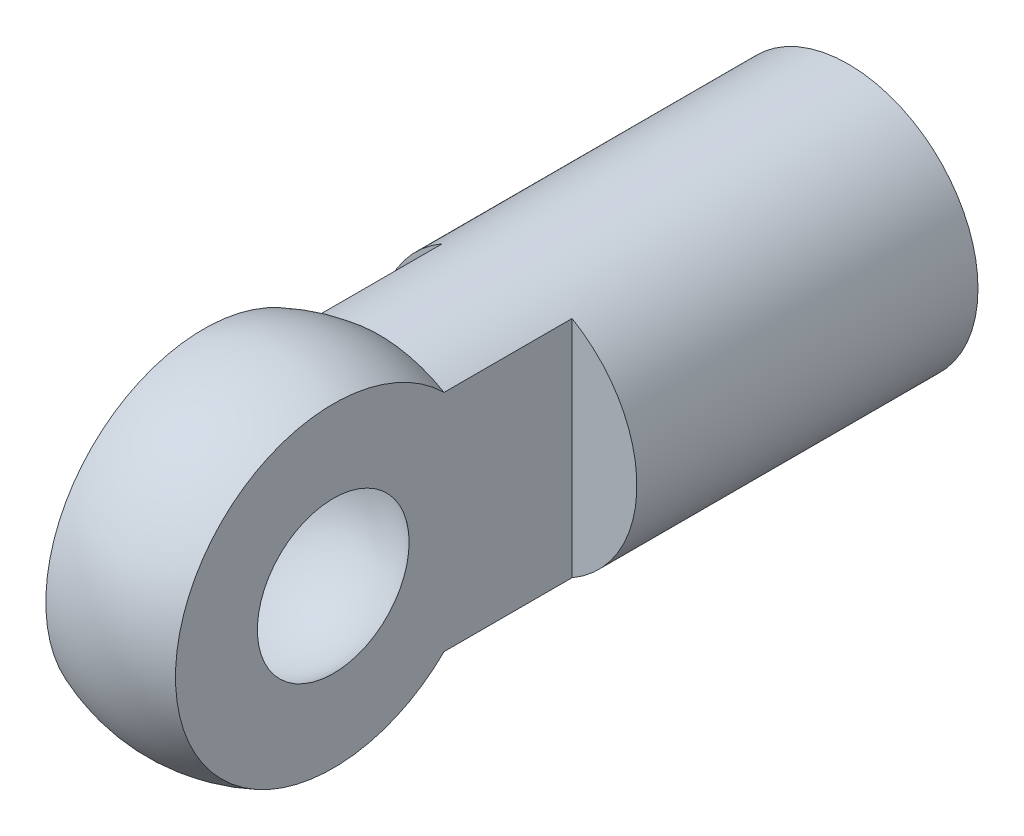
ISO-10303-21;
HEADER;
FILE_DESCRIPTION(('STEP AP214'),'2;1');
FILE_NAME('part.step','',(''),(''),'','','');
FILE_SCHEMA(('AUTOMOTIVE_DESIGN { 1 0 10303 214 1 1 1 1 }'));
ENDSEC;
DATA;
#1=APPLICATION_CONTEXT('core data for automotive mechanical design processes');
#2=APPLICATION_PROTOCOL_DEFINITION('international standard','automotive_design',2000,#1);
#3=PRODUCT_CONTEXT('',#1,'mechanical');
#4=PRODUCT('Part','Part','',(#3));
#5=PRODUCT_RELATED_PRODUCT_CATEGORY('part','',(#4));
#6=PRODUCT_DEFINITION_FORMATION('','',#4);
#7=PRODUCT_DEFINITION_CONTEXT('part definition',#1,'design');
#8=PRODUCT_DEFINITION('design','',#6,#7);
#9=PRODUCT_DEFINITION_SHAPE('','',#8);
#10=(LENGTH_UNIT() NAMED_UNIT(*) SI_UNIT(.MILLI.,.METRE.));
#11=(NAMED_UNIT(*) PLANE_ANGLE_UNIT() SI_UNIT($,.RADIAN.));
#12=(NAMED_UNIT(*) SI_UNIT($,.STERADIAN.) SOLID_ANGLE_UNIT());
#13=UNCERTAINTY_MEASURE_WITH_UNIT(LENGTH_MEASURE(1.E-05),#10,'distance_accuracy_value','');
#14=(GEOMETRIC_REPRESENTATION_CONTEXT(3) GLOBAL_UNCERTAINTY_ASSIGNED_CONTEXT((#13)) GLOBAL_UNIT_ASSIGNED_CONTEXT((#10,
#11,#12)) REPRESENTATION_CONTEXT('',''));
#15=CARTESIAN_POINT('',(0.,0.,0.));
#16=DIRECTION('',(0.,0.,1.));
#17=DIRECTION('',(1.,0.,0.));
#18=AXIS2_PLACEMENT_3D('',#15,#16,#17);
#19=CARTESIAN_POINT('',(-1.9,0.,-1.));
#20=DIRECTION('',(-1.,0.,0.));
#21=DIRECTION('',(0.,1.,0.));
#22=AXIS2_PLACEMENT_3D('',#19,#20,#21);
#23=PLANE('',#22);
#24=DIRECTION('',(0.,0.,-1.));
#25=VECTOR('',#24,1.);
#26=CARTESIAN_POINT('',(-1.9,-3.29089653438087,-10.1248076809272));
#27=LINE('',#26,#25);
#28=CARTESIAN_POINT('',(-1.9,-3.29089653438087,-3.24961536185438));
#29=VERTEX_POINT('',#28);
#30=CARTESIAN_POINT('',(-1.9,-3.29089653438087,-7.));
#31=VERTEX_POINT('',#30);
#32=EDGE_CURVE('E10',#29,#31,#27,.T.);
#33=ORIENTED_EDGE('',*,*,#32,.F.);
#34=CARTESIAN_POINT('',(-1.9,0.,0.));
#35=DIRECTION('',(1.,0.,0.));
#36=DIRECTION('',(0.,-1.,0.));
#37=AXIS2_PLACEMENT_3D('',#34,#35,#36);
#38=CIRCLE('',#37,4.62493243193887);
#39=CARTESIAN_POINT('',(-1.9,3.29089653438087,-3.24961536185438));
#40=VERTEX_POINT('',#39);
#41=EDGE_CURVE('E24',#40,#29,#38,.T.);
#42=ORIENTED_EDGE('',*,*,#41,.F.);
#43=DIRECTION('',(0.,0.,1.));
#44=VECTOR('',#43,1.);
#45=CARTESIAN_POINT('',(-1.9,3.29089653438087,-10.1248076809272));
#46=LINE('',#45,#44);
#47=CARTESIAN_POINT('',(-1.9,3.29089653438087,-7.));
#48=VERTEX_POINT('',#47);
#49=EDGE_CURVE('E98',#48,#40,#46,.T.);
#50=ORIENTED_EDGE('',*,*,#49,.F.);
#51=DIRECTION('',(0.,1.,0.));
#52=VECTOR('',#51,1.);
#53=CARTESIAN_POINT('',(-1.9,-3.8,-7.));
#54=LINE('',#53,#52);
#55=EDGE_CURVE('E94',#31,#48,#54,.T.);
#56=ORIENTED_EDGE('',*,*,#55,.F.);
#57=EDGE_LOOP('',(#33,#42,#50,#56));
#58=FACE_BOUND('',#57,.T.);
#59=CARTESIAN_POINT('',(-1.9,0.,0.));
#60=DIRECTION('',(-1.,0.,0.));
#61=DIRECTION('',(0.,0.,-1.));
#62=AXIS2_PLACEMENT_3D('',#59,#60,#61);
#63=CIRCLE('',#62,2.22387612065061);
#64=CARTESIAN_POINT('',(-1.9,0.,-2.22387612065061));
#65=VERTEX_POINT('',#64);
#66=EDGE_CURVE('E83',#65,#65,#63,.T.);
#67=ORIENTED_EDGE('',*,*,#66,.F.);
#68=EDGE_LOOP('',(#67));
#69=FACE_BOUND('',#68,.T.);
#70=ADVANCED_FACE('F15',(#58,#69),#23,.T.);
#71=CARTESIAN_POINT('',(0.,0.,0.));
#72=DIRECTION('',(1.,0.,0.));
#73=DIRECTION('',(0.,0.,-1.));
#74=AXIS2_PLACEMENT_3D('',#71,#72,#73);
#75=SPHERICAL_SURFACE('',#74,2.925);
#76=CARTESIAN_POINT('',(1.9,0.,0.));
#77=DIRECTION('',(1.,0.,0.));
#78=DIRECTION('',(0.,0.,-1.));
#79=AXIS2_PLACEMENT_3D('',#76,#77,#78);
#80=CIRCLE('',#79,2.22387612065061);
#81=CARTESIAN_POINT('',(1.9,0.,-2.22387612065061));
#82=VERTEX_POINT('',#81);
#83=EDGE_CURVE('E76',#82,#82,#80,.T.);
#84=ORIENTED_EDGE('',*,*,#83,.T.);
#85=EDGE_LOOP('',(#84));
#86=FACE_BOUND('',#85,.T.);
#87=ORIENTED_EDGE('',*,*,#66,.T.);
#88=EDGE_LOOP('',(#87));
#89=FACE_BOUND('',#88,.T.);
#90=ADVANCED_FACE('F162',(#86,#89),#75,.F.);
#91=CARTESIAN_POINT('',(1.9,0.,-1.));
#92=DIRECTION('',(1.,0.,0.));
#93=DIRECTION('',(0.,1.,0.));
#94=AXIS2_PLACEMENT_3D('',#91,#92,#93);
#95=PLANE('',#94);
#96=DIRECTION('',(0.,0.,1.));
#97=VECTOR('',#96,1.);
#98=CARTESIAN_POINT('',(1.9,-3.29089653438087,-10.1248076809272));
#99=LINE('',#98,#97);
#100=CARTESIAN_POINT('',(1.9,-3.29089653438087,-7.));
#101=VERTEX_POINT('',#100);
#102=CARTESIAN_POINT('',(1.9,-3.29089653438087,-3.24961536185438));
#103=VERTEX_POINT('',#102);
#104=EDGE_CURVE('E56',#101,#103,#99,.T.);
#105=ORIENTED_EDGE('',*,*,#104,.F.);
#106=DIRECTION('',(0.,1.,0.));
#107=VECTOR('',#106,1.);
#108=CARTESIAN_POINT('',(1.9,-3.8,-7.));
#109=LINE('',#108,#107);
#110=CARTESIAN_POINT('',(1.9,3.29089653438087,-7.));
#111=VERTEX_POINT('',#110);
#112=EDGE_CURVE('E77',#101,#111,#109,.T.);
#113=ORIENTED_EDGE('',*,*,#112,.T.);
#114=DIRECTION('',(0.,0.,-1.));
#115=VECTOR('',#114,1.);
#116=CARTESIAN_POINT('',(1.9,3.29089653438087,-10.1248076809272));
#117=LINE('',#116,#115);
#118=CARTESIAN_POINT('',(1.9,3.29089653438087,-3.24961536185438));
#119=VERTEX_POINT('',#118);
#120=EDGE_CURVE('E59',#119,#111,#117,.T.);
#121=ORIENTED_EDGE('',*,*,#120,.F.);
#122=CARTESIAN_POINT('',(1.9,0.,0.));
#123=DIRECTION('',(-1.,0.,0.));
#124=DIRECTION('',(0.,1.,0.));
#125=AXIS2_PLACEMENT_3D('',#122,#123,#124);
#126=CIRCLE('',#125,4.62493243193887);
#127=EDGE_CURVE('E51',#103,#119,#126,.T.);
#128=ORIENTED_EDGE('',*,*,#127,.F.);
#129=EDGE_LOOP('',(#105,#113,#121,#128));
#130=FACE_BOUND('',#129,.T.);
#131=ORIENTED_EDGE('',*,*,#83,.F.);
#132=EDGE_LOOP('',(#131));
#133=FACE_BOUND('',#132,.T.);
#134=ADVANCED_FACE('F53',(#130,#133),#95,.T.);
#135=CARTESIAN_POINT('',(0.,0.,0.));
#136=DIRECTION('',(1.,0.,0.));
#137=DIRECTION('',(0.,0.,-1.));
#138=AXIS2_PLACEMENT_3D('',#135,#136,#137);
#139=SPHERICAL_SURFACE('',#138,5.);
#140=ORIENTED_EDGE('',*,*,#41,.T.);
#141=CARTESIAN_POINT('',(0.,0.,-3.24961536185438));
#142=DIRECTION('',(0.,0.,-1.));
#143=DIRECTION('',(1.,0.,0.));
#144=AXIS2_PLACEMENT_3D('',#141,#142,#143);
#145=CIRCLE('',#144,3.8);
#146=EDGE_CURVE('E63',#103,#29,#145,.T.);
#147=ORIENTED_EDGE('',*,*,#146,.F.);
#148=ORIENTED_EDGE('',*,*,#127,.T.);
#149=CARTESIAN_POINT('',(0.,0.,-3.24961536185438));
#150=DIRECTION('',(0.,0.,-1.));
#151=DIRECTION('',(1.,0.,0.));
#152=AXIS2_PLACEMENT_3D('',#149,#150,#151);
#153=CIRCLE('',#152,3.8);
#154=EDGE_CURVE('E69',#40,#119,#153,.T.);
#155=ORIENTED_EDGE('',*,*,#154,.F.);
#156=EDGE_LOOP('',(#140,#147,#148,#155));
#157=FACE_BOUND('',#156,.T.);
#158=ADVANCED_FACE('F66',(#157),#139,.T.);
#159=CARTESIAN_POINT('',(0.,0.,-10.1248076809272));
#160=DIRECTION('',(0.,0.,-1.));
#161=DIRECTION('',(0.,1.,0.));
#162=AXIS2_PLACEMENT_3D('',#159,#160,#161);
#163=CYLINDRICAL_SURFACE('',#162,3.8);
#164=CARTESIAN_POINT('',(0.,0.,-17.));
#165=DIRECTION('',(0.,0.,-1.));
#166=DIRECTION('',(1.,0.,0.));
#167=AXIS2_PLACEMENT_3D('',#164,#165,#166);
#168=CIRCLE('',#167,3.8);
#169=CARTESIAN_POINT('',(3.8,0.,-17.));
#170=VERTEX_POINT('',#169);
#171=EDGE_CURVE('E122',#170,#170,#168,.T.);
#172=ORIENTED_EDGE('',*,*,#171,.F.);
#173=EDGE_LOOP('',(#172));
#174=FACE_BOUND('',#173,.T.);
#175=ORIENTED_EDGE('',*,*,#154,.T.);
#176=ORIENTED_EDGE('',*,*,#120,.T.);
#177=CARTESIAN_POINT('',(0.,0.,-7.));
#178=DIRECTION('',(0.,0.,-1.));
#179=DIRECTION('',(0.,1.,0.));
#180=AXIS2_PLACEMENT_3D('',#177,#178,#179);
#181=CIRCLE('',#180,3.8);
#182=EDGE_CURVE('E73',#111,#101,#181,.T.);
#183=ORIENTED_EDGE('',*,*,#182,.T.);
#184=ORIENTED_EDGE('',*,*,#104,.T.);
#185=ORIENTED_EDGE('',*,*,#146,.T.);
#186=ORIENTED_EDGE('',*,*,#32,.T.);
#187=CARTESIAN_POINT('',(0.,0.,-7.));
#188=DIRECTION('',(0.,0.,-1.));
#189=DIRECTION('',(0.,1.,0.));
#190=AXIS2_PLACEMENT_3D('',#187,#188,#189);
#191=CIRCLE('',#190,3.8);
#192=EDGE_CURVE('E113',#31,#48,#191,.T.);
#193=ORIENTED_EDGE('',*,*,#192,.T.);
#194=ORIENTED_EDGE('',*,*,#49,.T.);
#195=EDGE_LOOP('',(#175,#176,#183,#184,#185,#186,#193,#194));
#196=FACE_BOUND('',#195,.T.);
#197=ADVANCED_FACE('F71',(#174,#196),#163,.T.);
#198=CARTESIAN_POINT('',(-1.9,-3.8,-7.));
#199=DIRECTION('',(0.,0.,-1.));
#200=DIRECTION('',(0.,1.,0.));
#201=AXIS2_PLACEMENT_3D('',#198,#199,#200);
#202=PLANE('',#201);
#203=ORIENTED_EDGE('',*,*,#192,.F.);
#204=ORIENTED_EDGE('',*,*,#55,.T.);
#205=EDGE_LOOP('',(#203,#204));
#206=FACE_BOUND('',#205,.T.);
#207=ADVANCED_FACE('F116',(#206),#202,.F.);
#208=CARTESIAN_POINT('',(1.9,-3.8,-7.));
#209=DIRECTION('',(0.,0.,-1.));
#210=DIRECTION('',(0.,1.,0.));
#211=AXIS2_PLACEMENT_3D('',#208,#209,#210);
#212=PLANE('',#211);
#213=ORIENTED_EDGE('',*,*,#182,.F.);
#214=ORIENTED_EDGE('',*,*,#112,.F.);
#215=EDGE_LOOP('',(#213,#214));
#216=FACE_BOUND('',#215,.T.);
#217=ADVANCED_FACE('F148',(#216),#212,.F.);
#218=CARTESIAN_POINT('',(0.,1.3,-17.));
#219=DIRECTION('',(0.,0.,-1.));
#220=DIRECTION('',(0.,1.,0.));
#221=AXIS2_PLACEMENT_3D('',#218,#219,#220);
#222=PLANE('',#221);
#223=ORIENTED_EDGE('',*,*,#171,.T.);
#224=EDGE_LOOP('',(#223));
#225=FACE_BOUND('',#224,.T.);
#226=CARTESIAN_POINT('',(0.,0.,-17.));
#227=DIRECTION('',(0.,0.,-1.));
#228=DIRECTION('',(1.,0.,0.));
#229=AXIS2_PLACEMENT_3D('',#226,#227,#228);
#230=CIRCLE('',#229,1.3);
#231=CARTESIAN_POINT('',(1.3,0.,-17.));
#232=VERTEX_POINT('',#231);
#233=EDGE_CURVE('E118',#232,#232,#230,.T.);
#234=ORIENTED_EDGE('',*,*,#233,.F.);
#235=EDGE_LOOP('',(#234));
#236=FACE_BOUND('',#235,.T.);
#237=ADVANCED_FACE('F150',(#225,#236),#222,.T.);
#238=CARTESIAN_POINT('',(0.,0.,-10.75));
#239=DIRECTION('',(0.,0.,-1.));
#240=DIRECTION('',(0.,1.,0.));
#241=AXIS2_PLACEMENT_3D('',#238,#239,#240);
#242=CYLINDRICAL_SURFACE('',#241,1.3);
#243=ORIENTED_EDGE('',*,*,#233,.T.);
#244=EDGE_LOOP('',(#243));
#245=FACE_BOUND('',#244,.T.);
#246=CARTESIAN_POINT('',(0.,0.,-4.5));
#247=DIRECTION('',(0.,0.,-1.));
#248=DIRECTION('',(1.,0.,0.));
#249=AXIS2_PLACEMENT_3D('',#246,#247,#248);
#250=CIRCLE('',#249,1.3);
#251=CARTESIAN_POINT('',(1.3,0.,-4.5));
#252=VERTEX_POINT('',#251);
#253=EDGE_CURVE('E125',#252,#252,#250,.T.);
#254=ORIENTED_EDGE('',*,*,#253,.F.);
#255=EDGE_LOOP('',(#254));
#256=FACE_BOUND('',#255,.T.);
#257=ADVANCED_FACE('F157',(#245,#256),#242,.F.);
#258=CARTESIAN_POINT('',(0.,0.,-4.5));
#259=DIRECTION('',(0.,0.,-1.));
#260=DIRECTION('',(0.,1.,0.));
#261=AXIS2_PLACEMENT_3D('',#258,#259,#260);
#262=PLANE('',#261);
#263=ORIENTED_EDGE('',*,*,#253,.T.);
#264=EDGE_LOOP('',(#263));
#265=FACE_BOUND('',#264,.T.);
#266=ADVANCED_FACE('F186',(#265),#262,.T.);
#267=CLOSED_SHELL('',(#70,#90,#134,#158,#197,#207,#217,#237,#257,#266));
#268=MANIFOLD_SOLID_BREP('B1',#267);
#269=ADVANCED_BREP_SHAPE_REPRESENTATION('',(#18,#268),#14);
#270=SHAPE_DEFINITION_REPRESENTATION(#9,#269);
ENDSEC;
END-ISO-10303-21;
